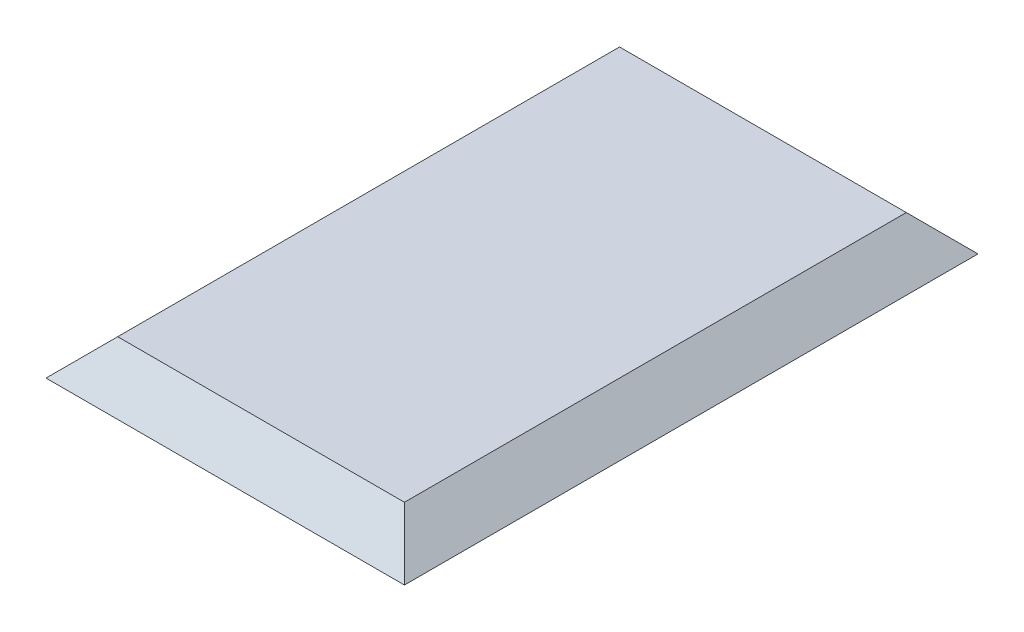
ISO-10303-21;
HEADER;
FILE_DESCRIPTION(('STEP AP214'),'2;1');
FILE_NAME('part.step','',(''),(''),'','','');
FILE_SCHEMA(('AUTOMOTIVE_DESIGN { 1 0 10303 214 1 1 1 1 }'));
ENDSEC;
DATA;
#1=APPLICATION_CONTEXT('core data for automotive mechanical design processes');
#2=APPLICATION_PROTOCOL_DEFINITION('international standard','automotive_design',2000,#1);
#3=PRODUCT_CONTEXT('',#1,'mechanical');
#4=PRODUCT('Part','Part','',(#3));
#5=PRODUCT_RELATED_PRODUCT_CATEGORY('part','',(#4));
#6=PRODUCT_DEFINITION_FORMATION('','',#4);
#7=PRODUCT_DEFINITION_CONTEXT('part definition',#1,'design');
#8=PRODUCT_DEFINITION('design','',#6,#7);
#9=PRODUCT_DEFINITION_SHAPE('','',#8);
#10=(LENGTH_UNIT() NAMED_UNIT(*) SI_UNIT(.MILLI.,.METRE.));
#11=(NAMED_UNIT(*) PLANE_ANGLE_UNIT() SI_UNIT($,.RADIAN.));
#12=(NAMED_UNIT(*) SI_UNIT($,.STERADIAN.) SOLID_ANGLE_UNIT());
#13=UNCERTAINTY_MEASURE_WITH_UNIT(LENGTH_MEASURE(1.E-05),#10,'distance_accuracy_value','');
#14=(GEOMETRIC_REPRESENTATION_CONTEXT(3) GLOBAL_UNCERTAINTY_ASSIGNED_CONTEXT((#13)) GLOBAL_UNIT_ASSIGNED_CONTEXT((#10,
#11,#12)) REPRESENTATION_CONTEXT('',''));
#15=CARTESIAN_POINT('',(0.,0.,0.));
#16=DIRECTION('',(0.,0.,1.));
#17=DIRECTION('',(1.,0.,0.));
#18=AXIS2_PLACEMENT_3D('',#15,#16,#17);
#19=CARTESIAN_POINT('',(0.,5.,0.));
#20=DIRECTION('',(0.,1.,0.));
#21=DIRECTION('',(0.,0.,1.));
#22=AXIS2_PLACEMENT_3D('',#19,#20,#21);
#23=PLANE('',#22);
#24=DIRECTION('',(1.,0.,0.));
#25=VECTOR('',#24,1.);
#26=CARTESIAN_POINT('',(-25.,5.00000000000001,35.));
#27=LINE('',#26,#25);
#28=CARTESIAN_POINT('',(-20.,5.,35.));
#29=VERTEX_POINT('',#28);
#30=CARTESIAN_POINT('',(19.9999999999999,5.00000000000001,35.));
#31=VERTEX_POINT('',#30);
#32=EDGE_CURVE('E48',#29,#31,#27,.T.);
#33=ORIENTED_EDGE('',*,*,#32,.T.);
#34=DIRECTION('',(0.,0.,1.));
#35=VECTOR('',#34,1.);
#36=CARTESIAN_POINT('',(20.,5.,-40.));
#37=LINE('',#36,#35);
#38=CARTESIAN_POINT('',(19.9999999999999,5.,-35.));
#39=VERTEX_POINT('',#38);
#40=EDGE_CURVE('E88',#39,#31,#37,.T.);
#41=ORIENTED_EDGE('',*,*,#40,.F.);
#42=DIRECTION('',(1.,0.,0.));
#43=VECTOR('',#42,1.);
#44=CARTESIAN_POINT('',(-25.,5.,-35.));
#45=LINE('',#44,#43);
#46=CARTESIAN_POINT('',(-20.,5.,-35.));
#47=VERTEX_POINT('',#46);
#48=EDGE_CURVE('E103',#47,#39,#45,.T.);
#49=ORIENTED_EDGE('',*,*,#48,.F.);
#50=DIRECTION('',(0.,0.,1.));
#51=VECTOR('',#50,1.);
#52=CARTESIAN_POINT('',(-20.,5.,-40.));
#53=LINE('',#52,#51);
#54=EDGE_CURVE('E91',#47,#29,#53,.T.);
#55=ORIENTED_EDGE('',*,*,#54,.T.);
#56=EDGE_LOOP('',(#33,#41,#49,#55));
#57=FACE_BOUND('',#56,.T.);
#58=ADVANCED_FACE('F33',(#57),#23,.T.);
#59=CARTESIAN_POINT('',(0.,0.,0.));
#60=DIRECTION('',(0.,1.,0.));
#61=DIRECTION('',(0.,0.,1.));
#62=AXIS2_PLACEMENT_3D('',#59,#60,#61);
#63=PLANE('',#62);
#64=DIRECTION('',(0.,0.,-1.));
#65=VECTOR('',#64,1.);
#66=CARTESIAN_POINT('',(25.,0.,-40.));
#67=LINE('',#66,#65);
#68=CARTESIAN_POINT('',(25.,0.,40.));
#69=VERTEX_POINT('',#68);
#70=CARTESIAN_POINT('',(25.,0.,-40.));
#71=VERTEX_POINT('',#70);
#72=EDGE_CURVE('E86',#69,#71,#67,.T.);
#73=ORIENTED_EDGE('',*,*,#72,.F.);
#74=DIRECTION('',(1.,0.,0.));
#75=VECTOR('',#74,1.);
#76=CARTESIAN_POINT('',(-25.,0.,40.));
#77=LINE('',#76,#75);
#78=CARTESIAN_POINT('',(-25.,0.,40.));
#79=VERTEX_POINT('',#78);
#80=EDGE_CURVE('E71',#79,#69,#77,.T.);
#81=ORIENTED_EDGE('',*,*,#80,.F.);
#82=DIRECTION('',(0.,0.,1.));
#83=VECTOR('',#82,1.);
#84=CARTESIAN_POINT('',(-25.,0.,-40.));
#85=LINE('',#84,#83);
#86=CARTESIAN_POINT('',(-25.,0.,-40.));
#87=VERTEX_POINT('',#86);
#88=EDGE_CURVE('E79',#87,#79,#85,.T.);
#89=ORIENTED_EDGE('',*,*,#88,.F.);
#90=DIRECTION('',(-1.,0.,0.));
#91=VECTOR('',#90,1.);
#92=CARTESIAN_POINT('',(-25.,0.,-40.));
#93=LINE('',#92,#91);
#94=EDGE_CURVE('E55',#71,#87,#93,.T.);
#95=ORIENTED_EDGE('',*,*,#94,.F.);
#96=EDGE_LOOP('',(#73,#81,#89,#95));
#97=FACE_BOUND('',#96,.T.);
#98=ADVANCED_FACE('F35',(#97),#63,.F.);
#99=CARTESIAN_POINT('',(25.,0.,-40.));
#100=DIRECTION('',(-0.707106781186543,-0.707106781186551,0.));
#101=DIRECTION('',(0.707106781186552,-0.707106781186544,0.));
#102=AXIS2_PLACEMENT_3D('',#99,#100,#101);
#103=PLANE('',#102);
#104=ORIENTED_EDGE('',*,*,#40,.T.);
#105=DIRECTION('',(0.57735026918963,-0.577350269189624,0.577350269189623));
#106=VECTOR('',#105,1.);
#107=CARTESIAN_POINT('',(-1.66666666666675,26.6666666666665,13.3333333333336));
#108=LINE('',#107,#106);
#109=EDGE_CURVE('E74',#31,#69,#108,.T.);
#110=ORIENTED_EDGE('',*,*,#109,.T.);
#111=ORIENTED_EDGE('',*,*,#72,.T.);
#112=DIRECTION('',(-0.577350269189628,0.577350269189622,0.577350269189628));
#113=VECTOR('',#112,1.);
#114=CARTESIAN_POINT('',(25.,0.,-40.));
#115=LINE('',#114,#113);
#116=EDGE_CURVE('E89',#71,#39,#115,.T.);
#117=ORIENTED_EDGE('',*,*,#116,.T.);
#118=EDGE_LOOP('',(#104,#110,#111,#117));
#119=FACE_BOUND('',#118,.T.);
#120=ADVANCED_FACE('F84',(#119),#103,.F.);
#121=CARTESIAN_POINT('',(-25.,0.,-40.));
#122=DIRECTION('',(0.707106781186549,-0.707106781186546,0.));
#123=DIRECTION('',(0.707106781186546,0.707106781186549,0.));
#124=AXIS2_PLACEMENT_3D('',#121,#122,#123);
#125=PLANE('',#124);
#126=ORIENTED_EDGE('',*,*,#88,.T.);
#127=DIRECTION('',(0.577350269189625,0.577350269189627,-0.577350269189626));
#128=VECTOR('',#127,1.);
#129=CARTESIAN_POINT('',(1.66666666666663,26.6666666666667,13.3333333333333));
#130=LINE('',#129,#128);
#131=EDGE_CURVE('E11',#79,#29,#130,.T.);
#132=ORIENTED_EDGE('',*,*,#131,.T.);
#133=ORIENTED_EDGE('',*,*,#54,.F.);
#134=DIRECTION('',(-0.577350269189622,-0.577350269189624,-0.577350269189631));
#135=VECTOR('',#134,1.);
#136=CARTESIAN_POINT('',(-25.,0.,-40.));
#137=LINE('',#136,#135);
#138=EDGE_CURVE('E41',#47,#87,#137,.T.);
#139=ORIENTED_EDGE('',*,*,#138,.T.);
#140=EDGE_LOOP('',(#126,#132,#133,#139));
#141=FACE_BOUND('',#140,.T.);
#142=ADVANCED_FACE('F100',(#141),#125,.F.);
#143=CARTESIAN_POINT('',(-25.,0.,-40.));
#144=DIRECTION('',(0.,-0.707106781186551,0.707106781186544));
#145=DIRECTION('',(0.,-0.707106781186544,-0.707106781186551));
#146=AXIS2_PLACEMENT_3D('',#143,#144,#145);
#147=PLANE('',#146);
#148=ORIENTED_EDGE('',*,*,#94,.T.);
#149=ORIENTED_EDGE('',*,*,#138,.F.);
#150=ORIENTED_EDGE('',*,*,#48,.T.);
#151=ORIENTED_EDGE('',*,*,#116,.F.);
#152=EDGE_LOOP('',(#148,#149,#150,#151));
#153=FACE_BOUND('',#152,.T.);
#154=ADVANCED_FACE('F102',(#153),#147,.F.);
#155=CARTESIAN_POINT('',(-25.,0.,40.));
#156=DIRECTION('',(0.,-0.707106781186547,-0.707106781186548));
#157=DIRECTION('',(0.,0.707106781186548,-0.707106781186547));
#158=AXIS2_PLACEMENT_3D('',#155,#156,#157);
#159=PLANE('',#158);
#160=ORIENTED_EDGE('',*,*,#32,.F.);
#161=ORIENTED_EDGE('',*,*,#131,.F.);
#162=ORIENTED_EDGE('',*,*,#80,.T.);
#163=ORIENTED_EDGE('',*,*,#109,.F.);
#164=EDGE_LOOP('',(#160,#161,#162,#163));
#165=FACE_BOUND('',#164,.T.);
#166=ADVANCED_FACE('F73',(#165),#159,.F.);
#167=CLOSED_SHELL('',(#58,#98,#120,#142,#154,#166));
#168=MANIFOLD_SOLID_BREP('B2',#167);
#169=ADVANCED_BREP_SHAPE_REPRESENTATION('',(#18,#168),#14);
#170=SHAPE_DEFINITION_REPRESENTATION(#9,#169);
ENDSEC;
END-ISO-10303-21;
